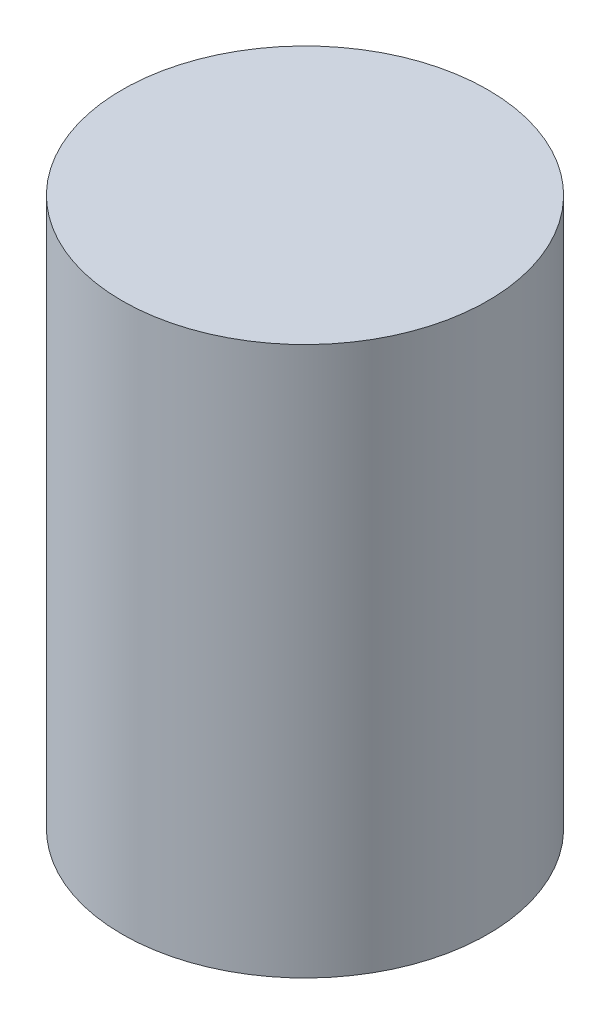
ISO-10303-21;
HEADER;
FILE_DESCRIPTION(('STEP AP214'),'2;1');
FILE_NAME('part.step','',(''),(''),'','','');
FILE_SCHEMA(('AUTOMOTIVE_DESIGN { 1 0 10303 214 1 1 1 1 }'));
ENDSEC;
DATA;
#1=APPLICATION_CONTEXT('core data for automotive mechanical design processes');
#2=APPLICATION_PROTOCOL_DEFINITION('international standard','automotive_design',2000,#1);
#3=PRODUCT_CONTEXT('',#1,'mechanical');
#4=PRODUCT('Part','Part','',(#3));
#5=PRODUCT_RELATED_PRODUCT_CATEGORY('part','',(#4));
#6=PRODUCT_DEFINITION_FORMATION('','',#4);
#7=PRODUCT_DEFINITION_CONTEXT('part definition',#1,'design');
#8=PRODUCT_DEFINITION('design','',#6,#7);
#9=PRODUCT_DEFINITION_SHAPE('','',#8);
#10=(LENGTH_UNIT() NAMED_UNIT(*) SI_UNIT(.MILLI.,.METRE.));
#11=(NAMED_UNIT(*) PLANE_ANGLE_UNIT() SI_UNIT($,.RADIAN.));
#12=(NAMED_UNIT(*) SI_UNIT($,.STERADIAN.) SOLID_ANGLE_UNIT());
#13=UNCERTAINTY_MEASURE_WITH_UNIT(LENGTH_MEASURE(1.E-05),#10,'distance_accuracy_value','');
#14=(GEOMETRIC_REPRESENTATION_CONTEXT(3) GLOBAL_UNCERTAINTY_ASSIGNED_CONTEXT((#13)) GLOBAL_UNIT_ASSIGNED_CONTEXT((#10,
#11,#12)) REPRESENTATION_CONTEXT('',''));
#15=CARTESIAN_POINT('',(0.,0.,0.));
#16=DIRECTION('',(0.,0.,1.));
#17=DIRECTION('',(1.,0.,0.));
#18=AXIS2_PLACEMENT_3D('',#15,#16,#17);
#19=CARTESIAN_POINT('',(0.,30.,0.));
#20=DIRECTION('',(0.,-1.,0.));
#21=DIRECTION('',(0.,0.,-1.));
#22=AXIS2_PLACEMENT_3D('',#19,#20,#21);
#23=CYLINDRICAL_SURFACE('',#22,10.);
#24=CARTESIAN_POINT('',(0.,30.,0.));
#25=DIRECTION('',(0.,1.,0.));
#26=DIRECTION('',(0.,0.,1.));
#27=AXIS2_PLACEMENT_3D('',#24,#25,#26);
#28=CIRCLE('',#27,10.);
#29=CARTESIAN_POINT('',(0.,30.,10.));
#30=VERTEX_POINT('',#29);
#31=EDGE_CURVE('E10',#30,#30,#28,.T.);
#32=ORIENTED_EDGE('',*,*,#31,.F.);
#33=EDGE_LOOP('',(#32));
#34=FACE_BOUND('',#33,.T.);
#35=CARTESIAN_POINT('',(0.,0.,0.));
#36=DIRECTION('',(0.,1.,0.));
#37=DIRECTION('',(0.,0.,1.));
#38=AXIS2_PLACEMENT_3D('',#35,#36,#37);
#39=CIRCLE('',#38,10.);
#40=CARTESIAN_POINT('',(0.,0.,10.));
#41=VERTEX_POINT('',#40);
#42=EDGE_CURVE('E40',#41,#41,#39,.T.);
#43=ORIENTED_EDGE('',*,*,#42,.T.);
#44=EDGE_LOOP('',(#43));
#45=FACE_BOUND('',#44,.T.);
#46=ADVANCED_FACE('F37',(#34,#45),#23,.T.);
#47=CARTESIAN_POINT('',(0.,30.,0.));
#48=DIRECTION('',(0.,1.,0.));
#49=DIRECTION('',(0.,0.,1.));
#50=AXIS2_PLACEMENT_3D('',#47,#48,#49);
#51=PLANE('',#50);
#52=ORIENTED_EDGE('',*,*,#31,.T.);
#53=EDGE_LOOP('',(#52));
#54=FACE_BOUND('',#53,.T.);
#55=ADVANCED_FACE('F54',(#54),#51,.T.);
#56=CARTESIAN_POINT('',(0.,0.,0.));
#57=DIRECTION('',(0.,1.,0.));
#58=DIRECTION('',(0.,0.,1.));
#59=AXIS2_PLACEMENT_3D('',#56,#57,#58);
#60=PLANE('',#59);
#61=ORIENTED_EDGE('',*,*,#42,.F.);
#62=EDGE_LOOP('',(#61));
#63=FACE_BOUND('',#62,.T.);
#64=ADVANCED_FACE('F52',(#63),#60,.F.);
#65=CLOSED_SHELL('',(#46,#55,#64));
#66=MANIFOLD_SOLID_BREP('B2',#65);
#67=ADVANCED_BREP_SHAPE_REPRESENTATION('',(#18,#66),#14);
#68=SHAPE_DEFINITION_REPRESENTATION(#9,#67);
ENDSEC;
END-ISO-10303-21;
